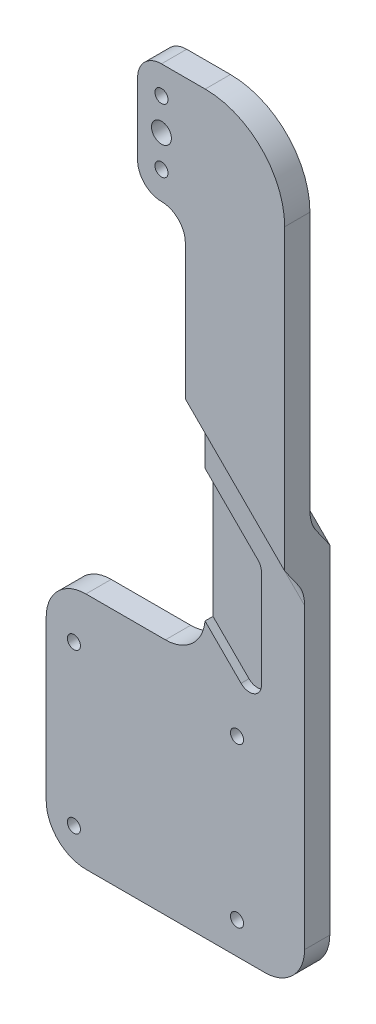
ISO-10303-21;
HEADER;
FILE_DESCRIPTION(('STEP AP214'),'2;1');
FILE_NAME('part.step','',(''),(''),'','','');
FILE_SCHEMA(('AUTOMOTIVE_DESIGN { 1 0 10303 214 1 1 1 1 }'));
ENDSEC;
DATA;
#1=APPLICATION_CONTEXT('core data for automotive mechanical design processes');
#2=APPLICATION_PROTOCOL_DEFINITION('international standard','automotive_design',2000,#1);
#3=PRODUCT_CONTEXT('',#1,'mechanical');
#4=PRODUCT('Part','Part','',(#3));
#5=PRODUCT_RELATED_PRODUCT_CATEGORY('part','',(#4));
#6=PRODUCT_DEFINITION_FORMATION('','',#4);
#7=PRODUCT_DEFINITION_CONTEXT('part definition',#1,'design');
#8=PRODUCT_DEFINITION('design','',#6,#7);
#9=PRODUCT_DEFINITION_SHAPE('','',#8);
#10=(LENGTH_UNIT() NAMED_UNIT(*) SI_UNIT(.MILLI.,.METRE.));
#11=(NAMED_UNIT(*) PLANE_ANGLE_UNIT() SI_UNIT($,.RADIAN.));
#12=(NAMED_UNIT(*) SI_UNIT($,.STERADIAN.) SOLID_ANGLE_UNIT());
#13=UNCERTAINTY_MEASURE_WITH_UNIT(LENGTH_MEASURE(1.E-05),#10,'distance_accuracy_value','');
#14=(GEOMETRIC_REPRESENTATION_CONTEXT(3) GLOBAL_UNCERTAINTY_ASSIGNED_CONTEXT((#13)) GLOBAL_UNIT_ASSIGNED_CONTEXT((#10,
#11,#12)) REPRESENTATION_CONTEXT('',''));
#15=CARTESIAN_POINT('',(0.,0.,0.));
#16=DIRECTION('',(0.,0.,1.));
#17=DIRECTION('',(1.,0.,0.));
#18=AXIS2_PLACEMENT_3D('',#15,#16,#17);
#19=CARTESIAN_POINT('',(6.,0.,6.35));
#20=DIRECTION('',(-1.,0.,0.));
#21=DIRECTION('',(0.,0.,1.));
#22=AXIS2_PLACEMENT_3D('',#19,#20,#21);
#23=PLANE('',#22);
#24=DIRECTION('',(0.,1.,0.));
#25=VECTOR('',#24,1.);
#26=CARTESIAN_POINT('',(6.00000000000002,-175.,-5.));
#27=LINE('',#26,#25);
#28=CARTESIAN_POINT('',(6.00000000000001,-105.,-5.));
#29=VERTEX_POINT('',#28);
#30=CARTESIAN_POINT('',(6.,-55.0000000000002,-5.));
#31=VERTEX_POINT('',#30);
#32=EDGE_CURVE('E278',#29,#31,#27,.T.);
#33=ORIENTED_EDGE('',*,*,#32,.F.);
#34=DIRECTION('',(0.,0.,1.));
#35=VECTOR('',#34,1.);
#36=CARTESIAN_POINT('',(6.,-105.,1.35));
#37=LINE('',#36,#35);
#38=CARTESIAN_POINT('',(6.,-105.,-0.65));
#39=VERTEX_POINT('',#38);
#40=EDGE_CURVE('E246',#29,#39,#37,.T.);
#41=ORIENTED_EDGE('',*,*,#40,.T.);
#42=DIRECTION('',(0.,-1.,0.));
#43=VECTOR('',#42,1.);
#44=CARTESIAN_POINT('',(6.,0.,-0.65));
#45=LINE('',#44,#43);
#46=CARTESIAN_POINT('',(6.,-72.6859435315228,-0.650000000000006));
#47=VERTEX_POINT('',#46);
#48=EDGE_CURVE('E226',#47,#39,#45,.T.);
#49=ORIENTED_EDGE('',*,*,#48,.F.);
#50=DIRECTION('',(0.,0.,-1.));
#51=VECTOR('',#50,1.);
#52=CARTESIAN_POINT('',(6.,-72.6859435315228,245.414474269938));
#53=LINE('',#52,#51);
#54=CARTESIAN_POINT('',(6.,-72.6859435315228,1.34999999999999));
#55=VERTEX_POINT('',#54);
#56=EDGE_CURVE('E231',#55,#47,#53,.T.);
#57=ORIENTED_EDGE('',*,*,#56,.F.);
#58=DIRECTION('',(0.,-1.,0.));
#59=VECTOR('',#58,1.);
#60=CARTESIAN_POINT('',(6.,0.,1.35));
#61=LINE('',#60,#59);
#62=CARTESIAN_POINT('',(6.,-65.0000000000002,1.35));
#63=VERTEX_POINT('',#62);
#64=EDGE_CURVE('E293',#63,#55,#61,.T.);
#65=ORIENTED_EDGE('',*,*,#64,.F.);
#66=CARTESIAN_POINT('',(6.,-65.0000000000002,6.35));
#67=DIRECTION('',(-1.,0.,0.));
#68=DIRECTION('',(0.,1.,0.));
#69=AXIS2_PLACEMENT_3D('',#66,#67,#68);
#70=ELLIPSE('',#69,7.07106781186544,5.);
#71=CARTESIAN_POINT('',(6.,-60.0000000000002,2.81446609406725));
#72=VERTEX_POINT('',#71);
#73=EDGE_CURVE('E442',#63,#72,#70,.F.);
#74=ORIENTED_EDGE('',*,*,#73,.T.);
#75=DIRECTION('',(0.,0.816496580927727,0.577350269189625));
#76=VECTOR('',#75,1.);
#77=CARTESIAN_POINT('',(6.,-39.3807118745773,17.394504550793));
#78=LINE('',#77,#76);
#79=CARTESIAN_POINT('',(6.,-55.0000000000002,6.35));
#80=VERTEX_POINT('',#79);
#81=EDGE_CURVE('E407',#72,#80,#78,.T.);
#82=ORIENTED_EDGE('',*,*,#81,.T.);
#83=DIRECTION('',(0.,1.,0.));
#84=VECTOR('',#83,1.);
#85=CARTESIAN_POINT('',(6.,0.,6.35));
#86=LINE('',#85,#84);
#87=CARTESIAN_POINT('',(6.,-21.,6.35));
#88=VERTEX_POINT('',#87);
#89=EDGE_CURVE('E317',#80,#88,#86,.T.);
#90=ORIENTED_EDGE('',*,*,#89,.T.);
#91=DIRECTION('',(0.,0.,-1.));
#92=VECTOR('',#91,1.);
#93=CARTESIAN_POINT('',(6.,-21.,6.35));
#94=LINE('',#93,#92);
#95=CARTESIAN_POINT('',(6.,-21.,0.));
#96=VERTEX_POINT('',#95);
#97=EDGE_CURVE('E332',#88,#96,#94,.T.);
#98=ORIENTED_EDGE('',*,*,#97,.T.);
#99=DIRECTION('',(0.,1.,0.));
#100=VECTOR('',#99,1.);
#101=CARTESIAN_POINT('',(6.,0.,0.));
#102=LINE('',#101,#100);
#103=CARTESIAN_POINT('',(6.,-45.0000000000003,0.));
#104=VERTEX_POINT('',#103);
#105=EDGE_CURVE('E345',#104,#96,#102,.T.);
#106=ORIENTED_EDGE('',*,*,#105,.F.);
#107=CARTESIAN_POINT('',(6.,-45.0000000000003,-5.));
#108=DIRECTION('',(-1.,0.,0.));
#109=DIRECTION('',(0.,1.,0.));
#110=AXIS2_PLACEMENT_3D('',#107,#108,#109);
#111=ELLIPSE('',#110,7.07106781186544,5.);
#112=CARTESIAN_POINT('',(6.,-50.0000000000003,-1.46446609406729));
#113=VERTEX_POINT('',#112);
#114=EDGE_CURVE('E436',#104,#113,#111,.F.);
#115=ORIENTED_EDGE('',*,*,#114,.T.);
#116=DIRECTION('',(0.,0.816496580927722,0.577350269189632));
#117=VECTOR('',#116,1.);
#118=CARTESIAN_POINT('',(6.,-55.0000000000002,-5.00000000000003));
#119=LINE('',#118,#117);
#120=EDGE_CURVE('E418',#113,#31,#119,.F.);
#121=ORIENTED_EDGE('',*,*,#120,.T.);
#122=EDGE_LOOP('',(#33,#41,#49,#57,#65,#74,#82,#90,#98,#106,#115,#121));
#123=FACE_BOUND('',#122,.T.);
#124=ADVANCED_FACE('F41',(#123),#23,.T.);
#125=CARTESIAN_POINT('',(0.,0.,1.35));
#126=DIRECTION('',(0.,0.,1.));
#127=DIRECTION('',(1.,0.,0.));
#128=AXIS2_PLACEMENT_3D('',#125,#126,#127);
#129=PLANE('',#128);
#130=CARTESIAN_POINT('',(14.,-167.,1.35));
#131=DIRECTION('',(0.,0.,1.));
#132=DIRECTION('',(1.,0.,0.));
#133=AXIS2_PLACEMENT_3D('',#130,#131,#132);
#134=CIRCLE('',#133,1.65000000000001);
#135=CARTESIAN_POINT('',(15.65,-167.,1.35));
#136=VERTEX_POINT('',#135);
#137=EDGE_CURVE('E282',#136,#136,#134,.F.);
#138=ORIENTED_EDGE('',*,*,#137,.T.);
#139=EDGE_LOOP('',(#138));
#140=FACE_BOUND('',#139,.T.);
#141=CARTESIAN_POINT('',(14.,-127.,1.35));
#142=DIRECTION('',(0.,0.,1.));
#143=DIRECTION('',(1.,0.,0.));
#144=AXIS2_PLACEMENT_3D('',#141,#142,#143);
#145=CIRCLE('',#144,1.65000000000001);
#146=CARTESIAN_POINT('',(15.65,-127.,1.35));
#147=VERTEX_POINT('',#146);
#148=EDGE_CURVE('E286',#147,#147,#145,.F.);
#149=ORIENTED_EDGE('',*,*,#148,.T.);
#150=EDGE_LOOP('',(#149));
#151=FACE_BOUND('',#150,.T.);
#152=DIRECTION('',(1.,0.,0.));
#153=VECTOR('',#152,1.);
#154=CARTESIAN_POINT('',(0.,-175.,1.35));
#155=LINE('',#154,#153);
#156=CARTESIAN_POINT('',(-24.,-175.,1.35));
#157=VERTEX_POINT('',#156);
#158=CARTESIAN_POINT('',(21.,-175.,1.35));
#159=VERTEX_POINT('',#158);
#160=EDGE_CURVE('E296',#157,#159,#155,.T.);
#161=ORIENTED_EDGE('',*,*,#160,.T.);
#162=CARTESIAN_POINT('',(21.,-165.,1.35));
#163=DIRECTION('',(0.,0.,1.));
#164=DIRECTION('',(1.,0.,0.));
#165=AXIS2_PLACEMENT_3D('',#162,#163,#164);
#166=CIRCLE('',#165,10.);
#167=CARTESIAN_POINT('',(31.,-165.,1.35));
#168=VERTEX_POINT('',#167);
#169=EDGE_CURVE('E507',#159,#168,#166,.T.);
#170=ORIENTED_EDGE('',*,*,#169,.T.);
#171=DIRECTION('',(0.,1.,0.));
#172=VECTOR('',#171,1.);
#173=CARTESIAN_POINT('',(31.,0.,1.35));
#174=LINE('',#173,#172);
#175=CARTESIAN_POINT('',(31.,-89.9999999999999,1.35));
#176=VERTEX_POINT('',#175);
#177=EDGE_CURVE('E290',#168,#176,#174,.T.);
#178=ORIENTED_EDGE('',*,*,#177,.T.);
#179=DIRECTION('',(-0.707106781186551,0.707106781186544,0.));
#180=VECTOR('',#179,1.);
#181=CARTESIAN_POINT('',(-29.5000000000001,-29.5000000000004,1.35));
#182=LINE('',#181,#180);
#183=EDGE_CURVE('E429',#176,#63,#182,.T.);
#184=ORIENTED_EDGE('',*,*,#183,.T.);
#185=ORIENTED_EDGE('',*,*,#64,.T.);
#186=DIRECTION('',(-0.707106781186551,0.707106781186544,0.));
#187=VECTOR('',#186,1.);
#188=CARTESIAN_POINT('',(20.142135623731,-86.8280791552536,1.34999999999999));
#189=LINE('',#188,#187);
#190=CARTESIAN_POINT('',(19.2634559672906,-85.9493994988132,1.34999999999999));
#191=VERTEX_POINT('',#190);
#192=EDGE_CURVE('E237',#191,#55,#189,.T.);
#193=ORIENTED_EDGE('',*,*,#192,.F.);
#194=CARTESIAN_POINT('',(17.142135623731,-88.0707198423729,1.34999999999999));
#195=DIRECTION('',(0.,0.,1.));
#196=DIRECTION('',(1.,0.,0.));
#197=AXIS2_PLACEMENT_3D('',#194,#195,#196);
#198=CIRCLE('',#197,3.);
#199=CARTESIAN_POINT('',(20.142135623731,-88.0707198423729,1.34999999999999));
#200=VERTEX_POINT('',#199);
#201=EDGE_CURVE('E467',#191,#200,#198,.F.);
#202=ORIENTED_EDGE('',*,*,#201,.T.);
#203=DIRECTION('',(0.,1.,0.));
#204=VECTOR('',#203,1.);
#205=CARTESIAN_POINT('',(20.142135623731,-120.082609769215,1.34999999999999));
#206=LINE('',#205,#204);
#207=CARTESIAN_POINT('',(20.142135623731,-112.839969082096,1.34999999999999));
#208=VERTEX_POINT('',#207);
#209=EDGE_CURVE('E588',#208,#200,#206,.T.);
#210=ORIENTED_EDGE('',*,*,#209,.F.);
#211=CARTESIAN_POINT('',(17.142135623731,-112.839969082096,1.34999999999999));
#212=DIRECTION('',(0.,0.,1.));
#213=DIRECTION('',(1.,0.,0.));
#214=AXIS2_PLACEMENT_3D('',#211,#212,#213);
#215=CIRCLE('',#214,3.);
#216=CARTESIAN_POINT('',(15.0208152801713,-114.961289425655,1.34999999999999));
#217=VERTEX_POINT('',#216);
#218=EDGE_CURVE('E470',#208,#217,#215,.F.);
#219=ORIENTED_EDGE('',*,*,#218,.T.);
#220=DIRECTION('',(0.707106781186547,-0.707106781186548,0.));
#221=VECTOR('',#220,1.);
#222=CARTESIAN_POINT('',(6.00000000000001,-105.940474145484,1.34999999999999));
#223=LINE('',#222,#221);
#224=CARTESIAN_POINT('',(5.95942662060434,-105.899900766088,1.34999999999999));
#225=VERTEX_POINT('',#224);
#226=EDGE_CURVE('E57',#225,#217,#223,.T.);
#227=ORIENTED_EDGE('',*,*,#226,.F.);
#228=CARTESIAN_POINT('',(-4.,-105.,1.35));
#229=DIRECTION('',(0.,0.,1.));
#230=DIRECTION('',(1.,0.,0.));
#231=AXIS2_PLACEMENT_3D('',#228,#229,#230);
#232=CIRCLE('',#231,10.);
#233=CARTESIAN_POINT('',(-4.,-115.,1.35));
#234=VERTEX_POINT('',#233);
#235=EDGE_CURVE('E50',#225,#234,#232,.F.);
#236=ORIENTED_EDGE('',*,*,#235,.T.);
#237=DIRECTION('',(-1.,0.,0.));
#238=VECTOR('',#237,1.);
#239=CARTESIAN_POINT('',(6.00000000000002,-115.,1.35));
#240=LINE('',#239,#238);
#241=CARTESIAN_POINT('',(-24.,-115.,1.35));
#242=VERTEX_POINT('',#241);
#243=EDGE_CURVE('E528',#234,#242,#240,.T.);
#244=ORIENTED_EDGE('',*,*,#243,.T.);
#245=CARTESIAN_POINT('',(-24.,-125.,1.35));
#246=DIRECTION('',(0.,0.,1.));
#247=DIRECTION('',(1.,0.,0.));
#248=AXIS2_PLACEMENT_3D('',#245,#246,#247);
#249=CIRCLE('',#248,10.);
#250=CARTESIAN_POINT('',(-34.,-125.,1.35));
#251=VERTEX_POINT('',#250);
#252=EDGE_CURVE('E501',#242,#251,#249,.T.);
#253=ORIENTED_EDGE('',*,*,#252,.T.);
#254=DIRECTION('',(0.,-1.,0.));
#255=VECTOR('',#254,1.);
#256=CARTESIAN_POINT('',(-34.,-175.,1.35));
#257=LINE('',#256,#255);
#258=CARTESIAN_POINT('',(-34.,-165.,1.35));
#259=VERTEX_POINT('',#258);
#260=EDGE_CURVE('E538',#251,#259,#257,.T.);
#261=ORIENTED_EDGE('',*,*,#260,.T.);
#262=CARTESIAN_POINT('',(-24.,-165.,1.35));
#263=DIRECTION('',(0.,0.,1.));
#264=DIRECTION('',(1.,0.,0.));
#265=AXIS2_PLACEMENT_3D('',#262,#263,#264);
#266=CIRCLE('',#265,10.);
#267=EDGE_CURVE('E504',#259,#157,#266,.T.);
#268=ORIENTED_EDGE('',*,*,#267,.T.);
#269=EDGE_LOOP('',(#161,#170,#178,#184,#185,#193,#202,#210,#219,#227,#236,#244,#253,#261,#268));
#270=FACE_BOUND('',#269,.T.);
#271=CARTESIAN_POINT('',(-27.0315901100417,-167.,1.35));
#272=DIRECTION('',(0.,0.,1.));
#273=DIRECTION('',(1.,0.,0.));
#274=AXIS2_PLACEMENT_3D('',#271,#272,#273);
#275=CIRCLE('',#274,1.65);
#276=CARTESIAN_POINT('',(-25.3815901100417,-167.,1.35));
#277=VERTEX_POINT('',#276);
#278=EDGE_CURVE('E539',#277,#277,#275,.T.);
#279=ORIENTED_EDGE('',*,*,#278,.F.);
#280=EDGE_LOOP('',(#279));
#281=FACE_BOUND('',#280,.T.);
#282=CARTESIAN_POINT('',(-27.0315901100417,-127.,1.35));
#283=DIRECTION('',(0.,0.,1.));
#284=DIRECTION('',(1.,0.,0.));
#285=AXIS2_PLACEMENT_3D('',#282,#283,#284);
#286=CIRCLE('',#285,1.65);
#287=CARTESIAN_POINT('',(-25.3815901100417,-127.,1.35));
#288=VERTEX_POINT('',#287);
#289=EDGE_CURVE('E584',#288,#288,#286,.T.);
#290=ORIENTED_EDGE('',*,*,#289,.F.);
#291=EDGE_LOOP('',(#290));
#292=FACE_BOUND('',#291,.T.);
#293=ADVANCED_FACE('F526',(#140,#151,#270,#281,#292),#129,.T.);
#294=CARTESIAN_POINT('',(0.,0.,0.));
#295=DIRECTION('',(0.,0.,1.));
#296=DIRECTION('',(1.,0.,0.));
#297=AXIS2_PLACEMENT_3D('',#294,#295,#296);
#298=PLANE('',#297);
#299=CARTESIAN_POINT('',(0.,8.,0.));
#300=DIRECTION('',(0.,0.,1.));
#301=DIRECTION('',(1.,0.,0.));
#302=AXIS2_PLACEMENT_3D('',#299,#300,#301);
#303=CIRCLE('',#302,1.65);
#304=CARTESIAN_POINT('',(1.65,8.,0.));
#305=VERTEX_POINT('',#304);
#306=EDGE_CURVE('E309',#305,#305,#303,.T.);
#307=ORIENTED_EDGE('',*,*,#306,.T.);
#308=EDGE_LOOP('',(#307));
#309=FACE_BOUND('',#308,.T.);
#310=CARTESIAN_POINT('',(0.,0.,0.));
#311=DIRECTION('',(0.,0.,1.));
#312=DIRECTION('',(1.,0.,0.));
#313=AXIS2_PLACEMENT_3D('',#310,#311,#312);
#314=CIRCLE('',#313,2.5);
#315=CARTESIAN_POINT('',(2.5,0.,0.));
#316=VERTEX_POINT('',#315);
#317=EDGE_CURVE('E352',#316,#316,#314,.T.);
#318=ORIENTED_EDGE('',*,*,#317,.T.);
#319=EDGE_LOOP('',(#318));
#320=FACE_BOUND('',#319,.T.);
#321=CARTESIAN_POINT('',(0.,-8.,0.));
#322=DIRECTION('',(0.,0.,1.));
#323=DIRECTION('',(1.,0.,0.));
#324=AXIS2_PLACEMENT_3D('',#321,#322,#323);
#325=CIRCLE('',#324,1.65);
#326=CARTESIAN_POINT('',(1.65,-8.,0.));
#327=VERTEX_POINT('',#326);
#328=EDGE_CURVE('E348',#327,#327,#325,.T.);
#329=ORIENTED_EDGE('',*,*,#328,.T.);
#330=EDGE_LOOP('',(#329));
#331=FACE_BOUND('',#330,.T.);
#332=DIRECTION('',(0.,-1.,0.));
#333=VECTOR('',#332,1.);
#334=CARTESIAN_POINT('',(31.,0.,0.));
#335=LINE('',#334,#333);
#336=CARTESIAN_POINT('',(31.,-5.,0.));
#337=VERTEX_POINT('',#336);
#338=CARTESIAN_POINT('',(31.,-70.,0.));
#339=VERTEX_POINT('',#338);
#340=EDGE_CURVE('E333',#337,#339,#335,.T.);
#341=ORIENTED_EDGE('',*,*,#340,.T.);
#342=DIRECTION('',(0.707106781186551,-0.707106781186544,0.));
#343=VECTOR('',#342,1.);
#344=CARTESIAN_POINT('',(7.46446609406727,-46.4644660940675,0.));
#345=LINE('',#344,#343);
#346=EDGE_CURVE('E422',#339,#104,#345,.F.);
#347=ORIENTED_EDGE('',*,*,#346,.T.);
#348=ORIENTED_EDGE('',*,*,#105,.T.);
#349=CARTESIAN_POINT('',(0.,-21.,0.));
#350=DIRECTION('',(0.,0.,1.));
#351=DIRECTION('',(1.,0.,0.));
#352=AXIS2_PLACEMENT_3D('',#349,#350,#351);
#353=CIRCLE('',#352,6.);
#354=CARTESIAN_POINT('',(0.,-15.,0.));
#355=VERTEX_POINT('',#354);
#356=EDGE_CURVE('E371',#96,#355,#353,.T.);
#357=ORIENTED_EDGE('',*,*,#356,.T.);
#358=CARTESIAN_POINT('',(0.,-9.,0.));
#359=DIRECTION('',(0.,0.,1.));
#360=DIRECTION('',(1.,0.,0.));
#361=AXIS2_PLACEMENT_3D('',#358,#359,#360);
#362=CIRCLE('',#361,6.);
#363=CARTESIAN_POINT('',(-6.,-9.,0.));
#364=VERTEX_POINT('',#363);
#365=EDGE_CURVE('E362',#355,#364,#362,.F.);
#366=ORIENTED_EDGE('',*,*,#365,.T.);
#367=DIRECTION('',(0.,1.,0.));
#368=VECTOR('',#367,1.);
#369=CARTESIAN_POINT('',(-6.,0.,0.));
#370=LINE('',#369,#368);
#371=CARTESIAN_POINT('',(-6.,9.,0.));
#372=VERTEX_POINT('',#371);
#373=EDGE_CURVE('E341',#364,#372,#370,.T.);
#374=ORIENTED_EDGE('',*,*,#373,.T.);
#375=CARTESIAN_POINT('',(0.,9.,0.));
#376=DIRECTION('',(0.,0.,1.));
#377=DIRECTION('',(1.,0.,0.));
#378=AXIS2_PLACEMENT_3D('',#375,#376,#377);
#379=CIRCLE('',#378,6.);
#380=CARTESIAN_POINT('',(0.,15.,0.));
#381=VERTEX_POINT('',#380);
#382=EDGE_CURVE('E385',#372,#381,#379,.F.);
#383=ORIENTED_EDGE('',*,*,#382,.T.);
#384=DIRECTION('',(1.,0.,0.));
#385=VECTOR('',#384,1.);
#386=CARTESIAN_POINT('',(0.,15.,0.));
#387=LINE('',#386,#385);
#388=CARTESIAN_POINT('',(11.,15.,0.));
#389=VERTEX_POINT('',#388);
#390=EDGE_CURVE('E337',#381,#389,#387,.T.);
#391=ORIENTED_EDGE('',*,*,#390,.T.);
#392=CARTESIAN_POINT('',(11.,-5.,0.));
#393=DIRECTION('',(0.,0.,1.));
#394=DIRECTION('',(1.,0.,0.));
#395=AXIS2_PLACEMENT_3D('',#392,#393,#394);
#396=CIRCLE('',#395,20.);
#397=EDGE_CURVE('E398',#389,#337,#396,.F.);
#398=ORIENTED_EDGE('',*,*,#397,.T.);
#399=EDGE_LOOP('',(#341,#347,#348,#357,#366,#374,#383,#391,#398));
#400=FACE_BOUND('',#399,.T.);
#401=ADVANCED_FACE('F623',(#309,#320,#331,#400),#298,.F.);
#402=CARTESIAN_POINT('',(0.,-175.,6.35));
#403=DIRECTION('',(0.,1.,0.));
#404=DIRECTION('',(0.,0.,1.));
#405=AXIS2_PLACEMENT_3D('',#402,#403,#404);
#406=PLANE('',#405);
#407=DIRECTION('',(-1.,0.,0.));
#408=VECTOR('',#407,1.);
#409=CARTESIAN_POINT('',(31.,-175.,-5.));
#410=LINE('',#409,#408);
#411=CARTESIAN_POINT('',(21.,-175.,-5.));
#412=VERTEX_POINT('',#411);
#413=CARTESIAN_POINT('',(-24.,-175.,-5.));
#414=VERTEX_POINT('',#413);
#415=EDGE_CURVE('E274',#412,#414,#410,.T.);
#416=ORIENTED_EDGE('',*,*,#415,.F.);
#417=DIRECTION('',(0.,0.,-1.));
#418=VECTOR('',#417,1.);
#419=CARTESIAN_POINT('',(21.,-175.,1.35));
#420=LINE('',#419,#418);
#421=EDGE_CURVE('E498',#412,#159,#420,.F.);
#422=ORIENTED_EDGE('',*,*,#421,.T.);
#423=ORIENTED_EDGE('',*,*,#160,.F.);
#424=DIRECTION('',(0.,0.,1.));
#425=VECTOR('',#424,1.);
#426=CARTESIAN_POINT('',(-24.,-175.,-5.));
#427=LINE('',#426,#425);
#428=EDGE_CURVE('E495',#157,#414,#427,.F.);
#429=ORIENTED_EDGE('',*,*,#428,.T.);
#430=EDGE_LOOP('',(#416,#422,#423,#429));
#431=FACE_BOUND('',#430,.T.);
#432=ADVANCED_FACE('F566',(#431),#406,.F.);
#433=CARTESIAN_POINT('',(14.,-127.,-3.65));
#434=DIRECTION('',(0.,0.,1.));
#435=DIRECTION('',(1.,0.,0.));
#436=AXIS2_PLACEMENT_3D('',#433,#434,#435);
#437=CYLINDRICAL_SURFACE('',#436,1.65000000000001);
#438=ORIENTED_EDGE('',*,*,#148,.F.);
#439=EDGE_LOOP('',(#438));
#440=FACE_BOUND('',#439,.T.);
#441=CARTESIAN_POINT('',(14.,-127.,-5.));
#442=DIRECTION('',(0.,0.,1.));
#443=DIRECTION('',(1.,0.,0.));
#444=AXIS2_PLACEMENT_3D('',#441,#442,#443);
#445=CIRCLE('',#444,1.65000000000001);
#446=CARTESIAN_POINT('',(15.65,-127.,-5.));
#447=VERTEX_POINT('',#446);
#448=EDGE_CURVE('E258',#447,#447,#445,.T.);
#449=ORIENTED_EDGE('',*,*,#448,.F.);
#450=EDGE_LOOP('',(#449));
#451=FACE_BOUND('',#450,.T.);
#452=ADVANCED_FACE('F755',(#440,#451),#437,.F.);
#453=CARTESIAN_POINT('',(14.,-167.,-3.65));
#454=DIRECTION('',(0.,0.,1.));
#455=DIRECTION('',(1.,0.,0.));
#456=AXIS2_PLACEMENT_3D('',#453,#454,#455);
#457=CYLINDRICAL_SURFACE('',#456,1.65000000000001);
#458=ORIENTED_EDGE('',*,*,#137,.F.);
#459=EDGE_LOOP('',(#458));
#460=FACE_BOUND('',#459,.T.);
#461=CARTESIAN_POINT('',(14.,-167.,-5.));
#462=DIRECTION('',(0.,0.,1.));
#463=DIRECTION('',(1.,0.,0.));
#464=AXIS2_PLACEMENT_3D('',#461,#462,#463);
#465=CIRCLE('',#464,1.65000000000002);
#466=CARTESIAN_POINT('',(15.65,-167.,-5.));
#467=VERTEX_POINT('',#466);
#468=EDGE_CURVE('E263',#467,#467,#465,.T.);
#469=ORIENTED_EDGE('',*,*,#468,.F.);
#470=EDGE_LOOP('',(#469));
#471=FACE_BOUND('',#470,.T.);
#472=ADVANCED_FACE('F640',(#460,#471),#457,.F.);
#473=CARTESIAN_POINT('',(31.,0.,6.35));
#474=DIRECTION('',(1.,0.,0.));
#475=DIRECTION('',(0.,1.,0.));
#476=AXIS2_PLACEMENT_3D('',#473,#474,#475);
#477=PLANE('',#476);
#478=ORIENTED_EDGE('',*,*,#177,.F.);
#479=DIRECTION('',(0.,0.,-1.));
#480=VECTOR('',#479,1.);
#481=CARTESIAN_POINT('',(31.,-165.,-5.));
#482=LINE('',#481,#480);
#483=CARTESIAN_POINT('',(31.,-165.,-5.));
#484=VERTEX_POINT('',#483);
#485=EDGE_CURVE('E482',#168,#484,#482,.T.);
#486=ORIENTED_EDGE('',*,*,#485,.T.);
#487=DIRECTION('',(0.,-1.,0.));
#488=VECTOR('',#487,1.);
#489=CARTESIAN_POINT('',(31.,-80.,-5.));
#490=LINE('',#489,#488);
#491=CARTESIAN_POINT('',(31.,-80.,-5.));
#492=VERTEX_POINT('',#491);
#493=EDGE_CURVE('E270',#492,#484,#490,.T.);
#494=ORIENTED_EDGE('',*,*,#493,.F.);
#495=DIRECTION('',(0.,-0.816496580927722,-0.577350269189632));
#496=VECTOR('',#495,1.);
#497=CARTESIAN_POINT('',(31.,-63.3333333333337,6.78511301977571));
#498=LINE('',#497,#496);
#499=CARTESIAN_POINT('',(31.,-75.0000000000001,-1.46446609406729));
#500=VERTEX_POINT('',#499);
#501=EDGE_CURVE('E414',#492,#500,#498,.F.);
#502=ORIENTED_EDGE('',*,*,#501,.T.);
#503=CARTESIAN_POINT('',(31.,-70.0000000000001,-5.));
#504=DIRECTION('',(1.,0.,0.));
#505=DIRECTION('',(0.,1.,0.));
#506=AXIS2_PLACEMENT_3D('',#503,#504,#505);
#507=ELLIPSE('',#506,7.07106781186544,5.);
#508=EDGE_CURVE('E439',#500,#339,#507,.F.);
#509=ORIENTED_EDGE('',*,*,#508,.T.);
#510=ORIENTED_EDGE('',*,*,#340,.F.);
#511=DIRECTION('',(0.,0.,-1.));
#512=VECTOR('',#511,1.);
#513=CARTESIAN_POINT('',(31.,-5.,6.35));
#514=LINE('',#513,#512);
#515=CARTESIAN_POINT('',(31.,-5.,6.35));
#516=VERTEX_POINT('',#515);
#517=EDGE_CURVE('E401',#337,#516,#514,.F.);
#518=ORIENTED_EDGE('',*,*,#517,.T.);
#519=DIRECTION('',(0.,-1.,0.));
#520=VECTOR('',#519,1.);
#521=CARTESIAN_POINT('',(31.,0.,6.35));
#522=LINE('',#521,#520);
#523=CARTESIAN_POINT('',(31.,-80.,6.35));
#524=VERTEX_POINT('',#523);
#525=EDGE_CURVE('E304',#516,#524,#522,.T.);
#526=ORIENTED_EDGE('',*,*,#525,.T.);
#527=DIRECTION('',(0.,-0.816496580927727,-0.577350269189625));
#528=VECTOR('',#527,1.);
#529=CARTESIAN_POINT('',(31.,-47.7140452079105,29.1796175705687));
#530=LINE('',#529,#528);
#531=CARTESIAN_POINT('',(31.,-85.,2.81446609406724));
#532=VERTEX_POINT('',#531);
#533=EDGE_CURVE('E410',#524,#532,#530,.T.);
#534=ORIENTED_EDGE('',*,*,#533,.T.);
#535=CARTESIAN_POINT('',(31.,-89.9999999999999,6.35));
#536=DIRECTION('',(1.,0.,0.));
#537=DIRECTION('',(0.,1.,0.));
#538=AXIS2_PLACEMENT_3D('',#535,#536,#537);
#539=ELLIPSE('',#538,7.07106781186544,5.);
#540=EDGE_CURVE('E445',#532,#176,#539,.F.);
#541=ORIENTED_EDGE('',*,*,#540,.T.);
#542=EDGE_LOOP('',(#478,#486,#494,#502,#509,#510,#518,#526,#534,#541));
#543=FACE_BOUND('',#542,.T.);
#544=ADVANCED_FACE('F557',(#543),#477,.T.);
#545=CARTESIAN_POINT('',(0.,15.,6.35));
#546=DIRECTION('',(0.,1.,0.));
#547=DIRECTION('',(0.,0.,1.));
#548=AXIS2_PLACEMENT_3D('',#545,#546,#547);
#549=PLANE('',#548);
#550=DIRECTION('',(1.,0.,0.));
#551=VECTOR('',#550,1.);
#552=CARTESIAN_POINT('',(0.,15.,6.35));
#553=LINE('',#552,#551);
#554=CARTESIAN_POINT('',(0.,15.,6.35));
#555=VERTEX_POINT('',#554);
#556=CARTESIAN_POINT('',(11.,15.,6.35));
#557=VERTEX_POINT('',#556);
#558=EDGE_CURVE('E308',#555,#557,#553,.T.);
#559=ORIENTED_EDGE('',*,*,#558,.T.);
#560=DIRECTION('',(0.,0.,-1.));
#561=VECTOR('',#560,1.);
#562=CARTESIAN_POINT('',(11.,15.,6.35));
#563=LINE('',#562,#561);
#564=EDGE_CURVE('E394',#557,#389,#563,.T.);
#565=ORIENTED_EDGE('',*,*,#564,.T.);
#566=ORIENTED_EDGE('',*,*,#390,.F.);
#567=DIRECTION('',(0.,0.,-1.));
#568=VECTOR('',#567,1.);
#569=CARTESIAN_POINT('',(0.,15.,6.35));
#570=LINE('',#569,#568);
#571=EDGE_CURVE('E388',#381,#555,#570,.F.);
#572=ORIENTED_EDGE('',*,*,#571,.T.);
#573=EDGE_LOOP('',(#559,#565,#566,#572));
#574=FACE_BOUND('',#573,.T.);
#575=ADVANCED_FACE('F633',(#574),#549,.T.);
#576=CARTESIAN_POINT('',(-6.,0.,6.35));
#577=DIRECTION('',(-1.,0.,0.));
#578=DIRECTION('',(0.,-1.,0.));
#579=AXIS2_PLACEMENT_3D('',#576,#577,#578);
#580=PLANE('',#579);
#581=DIRECTION('',(0.,1.,0.));
#582=VECTOR('',#581,1.);
#583=CARTESIAN_POINT('',(-6.,0.,6.35));
#584=LINE('',#583,#582);
#585=CARTESIAN_POINT('',(-6.,-9.,6.35));
#586=VERTEX_POINT('',#585);
#587=CARTESIAN_POINT('',(-6.,9.,6.35));
#588=VERTEX_POINT('',#587);
#589=EDGE_CURVE('E313',#586,#588,#584,.T.);
#590=ORIENTED_EDGE('',*,*,#589,.T.);
#591=DIRECTION('',(0.,0.,-1.));
#592=VECTOR('',#591,1.);
#593=CARTESIAN_POINT('',(-6.,9.,6.35));
#594=LINE('',#593,#592);
#595=EDGE_CURVE('E378',#588,#372,#594,.T.);
#596=ORIENTED_EDGE('',*,*,#595,.T.);
#597=ORIENTED_EDGE('',*,*,#373,.F.);
#598=DIRECTION('',(0.,0.,-1.));
#599=VECTOR('',#598,1.);
#600=CARTESIAN_POINT('',(-6.,-9.,6.35));
#601=LINE('',#600,#599);
#602=EDGE_CURVE('E365',#364,#586,#601,.F.);
#603=ORIENTED_EDGE('',*,*,#602,.T.);
#604=EDGE_LOOP('',(#590,#596,#597,#603));
#605=FACE_BOUND('',#604,.T.);
#606=ADVANCED_FACE('F629',(#605),#580,.T.);
#607=CARTESIAN_POINT('',(0.,0.,6.35));
#608=DIRECTION('',(0.,0.,-1.));
#609=DIRECTION('',(-1.,0.,0.));
#610=AXIS2_PLACEMENT_3D('',#607,#608,#609);
#611=CYLINDRICAL_SURFACE('',#610,2.5);
#612=CARTESIAN_POINT('',(0.,0.,6.35));
#613=DIRECTION('',(0.,0.,1.));
#614=DIRECTION('',(1.,0.,0.));
#615=AXIS2_PLACEMENT_3D('',#612,#613,#614);
#616=CIRCLE('',#615,2.5);
#617=CARTESIAN_POINT('',(2.5,0.,6.35));
#618=VERTEX_POINT('',#617);
#619=EDGE_CURVE('E324',#618,#618,#616,.T.);
#620=ORIENTED_EDGE('',*,*,#619,.T.);
#621=EDGE_LOOP('',(#620));
#622=FACE_BOUND('',#621,.T.);
#623=ORIENTED_EDGE('',*,*,#317,.F.);
#624=EDGE_LOOP('',(#623));
#625=FACE_BOUND('',#624,.T.);
#626=ADVANCED_FACE('F632',(#622,#625),#611,.F.);
#627=CARTESIAN_POINT('',(0.,-8.,6.35));
#628=DIRECTION('',(0.,0.,-1.));
#629=DIRECTION('',(-1.,0.,0.));
#630=AXIS2_PLACEMENT_3D('',#627,#628,#629);
#631=CYLINDRICAL_SURFACE('',#630,1.65);
#632=CARTESIAN_POINT('',(0.,-8.,6.35));
#633=DIRECTION('',(0.,0.,1.));
#634=DIRECTION('',(1.,0.,0.));
#635=AXIS2_PLACEMENT_3D('',#632,#633,#634);
#636=CIRCLE('',#635,1.65);
#637=CARTESIAN_POINT('',(1.65,-8.,6.35));
#638=VERTEX_POINT('',#637);
#639=EDGE_CURVE('E320',#638,#638,#636,.T.);
#640=ORIENTED_EDGE('',*,*,#639,.T.);
#641=EDGE_LOOP('',(#640));
#642=FACE_BOUND('',#641,.T.);
#643=ORIENTED_EDGE('',*,*,#328,.F.);
#644=EDGE_LOOP('',(#643));
#645=FACE_BOUND('',#644,.T.);
#646=ADVANCED_FACE('F792',(#642,#645),#631,.F.);
#647=CARTESIAN_POINT('',(0.,8.,6.35));
#648=DIRECTION('',(0.,0.,-1.));
#649=DIRECTION('',(-1.,0.,0.));
#650=AXIS2_PLACEMENT_3D('',#647,#648,#649);
#651=CYLINDRICAL_SURFACE('',#650,1.65);
#652=CARTESIAN_POINT('',(0.,8.,6.35));
#653=DIRECTION('',(0.,0.,1.));
#654=DIRECTION('',(1.,0.,0.));
#655=AXIS2_PLACEMENT_3D('',#652,#653,#654);
#656=CIRCLE('',#655,1.65);
#657=CARTESIAN_POINT('',(1.65,8.,6.35));
#658=VERTEX_POINT('',#657);
#659=EDGE_CURVE('E328',#658,#658,#656,.T.);
#660=ORIENTED_EDGE('',*,*,#659,.T.);
#661=EDGE_LOOP('',(#660));
#662=FACE_BOUND('',#661,.T.);
#663=ORIENTED_EDGE('',*,*,#306,.F.);
#664=EDGE_LOOP('',(#663));
#665=FACE_BOUND('',#664,.T.);
#666=ADVANCED_FACE('F800',(#662,#665),#651,.F.);
#667=CARTESIAN_POINT('',(0.,0.,6.35));
#668=DIRECTION('',(0.,0.,1.));
#669=DIRECTION('',(1.,0.,0.));
#670=AXIS2_PLACEMENT_3D('',#667,#668,#669);
#671=PLANE('',#670);
#672=DIRECTION('',(-0.707106781186551,0.707106781186544,0.));
#673=VECTOR('',#672,1.);
#674=CARTESIAN_POINT('',(-24.5000000000001,-24.5000000000004,6.35));
#675=LINE('',#674,#673);
#676=EDGE_CURVE('E281',#524,#80,#675,.T.);
#677=ORIENTED_EDGE('',*,*,#676,.F.);
#678=ORIENTED_EDGE('',*,*,#525,.F.);
#679=CARTESIAN_POINT('',(11.,-5.,6.35));
#680=DIRECTION('',(0.,0.,1.));
#681=DIRECTION('',(1.,0.,0.));
#682=AXIS2_PLACEMENT_3D('',#679,#680,#681);
#683=CIRCLE('',#682,20.);
#684=EDGE_CURVE('E404',#516,#557,#683,.T.);
#685=ORIENTED_EDGE('',*,*,#684,.T.);
#686=ORIENTED_EDGE('',*,*,#558,.F.);
#687=CARTESIAN_POINT('',(0.,9.,6.35));
#688=DIRECTION('',(0.,0.,1.));
#689=DIRECTION('',(1.,0.,0.));
#690=AXIS2_PLACEMENT_3D('',#687,#688,#689);
#691=CIRCLE('',#690,6.);
#692=EDGE_CURVE('E391',#555,#588,#691,.T.);
#693=ORIENTED_EDGE('',*,*,#692,.T.);
#694=ORIENTED_EDGE('',*,*,#589,.F.);
#695=CARTESIAN_POINT('',(0.,-9.,6.35));
#696=DIRECTION('',(0.,0.,1.));
#697=DIRECTION('',(1.,0.,0.));
#698=AXIS2_PLACEMENT_3D('',#695,#696,#697);
#699=CIRCLE('',#698,6.);
#700=CARTESIAN_POINT('',(0.,-15.,6.35));
#701=VERTEX_POINT('',#700);
#702=EDGE_CURVE('E368',#586,#701,#699,.T.);
#703=ORIENTED_EDGE('',*,*,#702,.T.);
#704=CARTESIAN_POINT('',(0.,-21.,6.35));
#705=DIRECTION('',(0.,0.,1.));
#706=DIRECTION('',(1.,0.,0.));
#707=AXIS2_PLACEMENT_3D('',#704,#705,#706);
#708=CIRCLE('',#707,6.);
#709=EDGE_CURVE('E374',#701,#88,#708,.F.);
#710=ORIENTED_EDGE('',*,*,#709,.T.);
#711=ORIENTED_EDGE('',*,*,#89,.F.);
#712=EDGE_LOOP('',(#677,#678,#685,#686,#693,#694,#703,#710,#711));
#713=FACE_BOUND('',#712,.T.);
#714=ORIENTED_EDGE('',*,*,#639,.F.);
#715=EDGE_LOOP('',(#714));
#716=FACE_BOUND('',#715,.T.);
#717=ORIENTED_EDGE('',*,*,#619,.F.);
#718=EDGE_LOOP('',(#717));
#719=FACE_BOUND('',#718,.T.);
#720=ORIENTED_EDGE('',*,*,#659,.F.);
#721=EDGE_LOOP('',(#720));
#722=FACE_BOUND('',#721,.T.);
#723=ADVANCED_FACE('F649',(#713,#716,#719,#722),#671,.T.);
#724=CARTESIAN_POINT('',(0.,-9.,6.35));
#725=DIRECTION('',(0.,0.,1.));
#726=DIRECTION('',(1.,0.,0.));
#727=AXIS2_PLACEMENT_3D('',#724,#725,#726);
#728=CYLINDRICAL_SURFACE('',#727,6.);
#729=DIRECTION('',(0.,0.,-1.));
#730=VECTOR('',#729,1.);
#731=CARTESIAN_POINT('',(0.,-15.,0.));
#732=LINE('',#731,#730);
#733=EDGE_CURVE('E300',#701,#355,#732,.T.);
#734=ORIENTED_EDGE('',*,*,#733,.F.);
#735=ORIENTED_EDGE('',*,*,#702,.F.);
#736=ORIENTED_EDGE('',*,*,#602,.F.);
#737=ORIENTED_EDGE('',*,*,#365,.F.);
#738=EDGE_LOOP('',(#734,#735,#736,#737));
#739=FACE_BOUND('',#738,.T.);
#740=ADVANCED_FACE('F645',(#739),#728,.T.);
#741=CARTESIAN_POINT('',(0.,-21.,6.35));
#742=DIRECTION('',(0.,0.,-1.));
#743=DIRECTION('',(-1.,0.,0.));
#744=AXIS2_PLACEMENT_3D('',#741,#742,#743);
#745=CYLINDRICAL_SURFACE('',#744,6.);
#746=ORIENTED_EDGE('',*,*,#709,.F.);
#747=ORIENTED_EDGE('',*,*,#733,.T.);
#748=ORIENTED_EDGE('',*,*,#356,.F.);
#749=ORIENTED_EDGE('',*,*,#97,.F.);
#750=EDGE_LOOP('',(#746,#747,#748,#749));
#751=FACE_BOUND('',#750,.T.);
#752=ADVANCED_FACE('F641',(#751),#745,.F.);
#753=CARTESIAN_POINT('',(0.,9.,6.35));
#754=DIRECTION('',(0.,0.,-1.));
#755=DIRECTION('',(-1.,0.,0.));
#756=AXIS2_PLACEMENT_3D('',#753,#754,#755);
#757=CYLINDRICAL_SURFACE('',#756,6.);
#758=ORIENTED_EDGE('',*,*,#692,.F.);
#759=ORIENTED_EDGE('',*,*,#571,.F.);
#760=ORIENTED_EDGE('',*,*,#382,.F.);
#761=ORIENTED_EDGE('',*,*,#595,.F.);
#762=EDGE_LOOP('',(#758,#759,#760,#761));
#763=FACE_BOUND('',#762,.T.);
#764=ADVANCED_FACE('F644',(#763),#757,.T.);
#765=CARTESIAN_POINT('',(11.,-5.,6.35));
#766=DIRECTION('',(0.,0.,-1.));
#767=DIRECTION('',(-1.,0.,0.));
#768=AXIS2_PLACEMENT_3D('',#765,#766,#767);
#769=CYLINDRICAL_SURFACE('',#768,20.);
#770=ORIENTED_EDGE('',*,*,#684,.F.);
#771=ORIENTED_EDGE('',*,*,#517,.F.);
#772=ORIENTED_EDGE('',*,*,#397,.F.);
#773=ORIENTED_EDGE('',*,*,#564,.F.);
#774=EDGE_LOOP('',(#770,#771,#772,#773));
#775=FACE_BOUND('',#774,.T.);
#776=ADVANCED_FACE('F653',(#775),#769,.T.);
#777=CARTESIAN_POINT('',(0.,0.,-5.));
#778=DIRECTION('',(0.,0.,-1.));
#779=DIRECTION('',(-1.,0.,0.));
#780=AXIS2_PLACEMENT_3D('',#777,#778,#779);
#781=PLANE('',#780);
#782=ORIENTED_EDGE('',*,*,#448,.T.);
#783=EDGE_LOOP('',(#782));
#784=FACE_BOUND('',#783,.T.);
#785=ORIENTED_EDGE('',*,*,#468,.T.);
#786=EDGE_LOOP('',(#785));
#787=FACE_BOUND('',#786,.T.);
#788=ORIENTED_EDGE('',*,*,#493,.T.);
#789=CARTESIAN_POINT('',(21.,-165.,-5.));
#790=DIRECTION('',(0.,0.,-1.));
#791=DIRECTION('',(-1.,0.,0.));
#792=AXIS2_PLACEMENT_3D('',#789,#790,#791);
#793=CIRCLE('',#792,10.);
#794=EDGE_CURVE('E492',#484,#412,#793,.T.);
#795=ORIENTED_EDGE('',*,*,#794,.T.);
#796=ORIENTED_EDGE('',*,*,#415,.T.);
#797=CARTESIAN_POINT('',(-24.,-165.,-5.));
#798=DIRECTION('',(0.,0.,-1.));
#799=DIRECTION('',(-1.,0.,0.));
#800=AXIS2_PLACEMENT_3D('',#797,#798,#799);
#801=CIRCLE('',#800,10.);
#802=CARTESIAN_POINT('',(-34.,-165.,-5.));
#803=VERTEX_POINT('',#802);
#804=EDGE_CURVE('E489',#414,#803,#801,.T.);
#805=ORIENTED_EDGE('',*,*,#804,.T.);
#806=DIRECTION('',(0.,-1.,0.));
#807=VECTOR('',#806,1.);
#808=CARTESIAN_POINT('',(-34.,-175.,-5.));
#809=LINE('',#808,#807);
#810=CARTESIAN_POINT('',(-34.,-125.,-5.));
#811=VERTEX_POINT('',#810);
#812=EDGE_CURVE('E579',#811,#803,#809,.T.);
#813=ORIENTED_EDGE('',*,*,#812,.F.);
#814=CARTESIAN_POINT('',(-24.,-125.,-5.));
#815=DIRECTION('',(0.,0.,-1.));
#816=DIRECTION('',(-1.,0.,0.));
#817=AXIS2_PLACEMENT_3D('',#814,#815,#816);
#818=CIRCLE('',#817,10.);
#819=CARTESIAN_POINT('',(-24.,-115.,-5.));
#820=VERTEX_POINT('',#819);
#821=EDGE_CURVE('E486',#811,#820,#818,.T.);
#822=ORIENTED_EDGE('',*,*,#821,.T.);
#823=DIRECTION('',(-1.,0.,0.));
#824=VECTOR('',#823,1.);
#825=CARTESIAN_POINT('',(6.00000000000002,-115.,-5.));
#826=LINE('',#825,#824);
#827=CARTESIAN_POINT('',(-4.,-115.,-5.));
#828=VERTEX_POINT('',#827);
#829=EDGE_CURVE('E546',#828,#820,#826,.T.);
#830=ORIENTED_EDGE('',*,*,#829,.F.);
#831=CARTESIAN_POINT('',(-4.,-105.,-5.));
#832=DIRECTION('',(0.,0.,-1.));
#833=DIRECTION('',(-1.,0.,0.));
#834=AXIS2_PLACEMENT_3D('',#831,#832,#833);
#835=CIRCLE('',#834,10.);
#836=EDGE_CURVE('E11',#828,#29,#835,.F.);
#837=ORIENTED_EDGE('',*,*,#836,.T.);
#838=ORIENTED_EDGE('',*,*,#32,.T.);
#839=DIRECTION('',(0.707106781186551,-0.707106781186544,0.));
#840=VECTOR('',#839,1.);
#841=CARTESIAN_POINT('',(6.,-55.0000000000002,-5.));
#842=LINE('',#841,#840);
#843=EDGE_CURVE('E262',#31,#492,#842,.T.);
#844=ORIENTED_EDGE('',*,*,#843,.T.);
#845=EDGE_LOOP('',(#788,#795,#796,#805,#813,#822,#830,#837,#838,#844));
#846=FACE_BOUND('',#845,.T.);
#847=CARTESIAN_POINT('',(-27.0315901100417,-167.,-5.));
#848=DIRECTION('',(0.,0.,-1.));
#849=DIRECTION('',(-1.,0.,0.));
#850=AXIS2_PLACEMENT_3D('',#847,#848,#849);
#851=CIRCLE('',#850,1.65);
#852=CARTESIAN_POINT('',(-28.6815901100417,-167.,-5.));
#853=VERTEX_POINT('',#852);
#854=EDGE_CURVE('E254',#853,#853,#851,.F.);
#855=ORIENTED_EDGE('',*,*,#854,.T.);
#856=EDGE_LOOP('',(#855));
#857=FACE_BOUND('',#856,.T.);
#858=CARTESIAN_POINT('',(-27.0315901100417,-127.,-5.));
#859=DIRECTION('',(0.,0.,-1.));
#860=DIRECTION('',(-1.,0.,0.));
#861=AXIS2_PLACEMENT_3D('',#858,#859,#860);
#862=CIRCLE('',#861,1.65);
#863=CARTESIAN_POINT('',(-28.6815901100417,-127.,-5.));
#864=VERTEX_POINT('',#863);
#865=EDGE_CURVE('E248',#864,#864,#862,.F.);
#866=ORIENTED_EDGE('',*,*,#865,.T.);
#867=EDGE_LOOP('',(#866));
#868=FACE_BOUND('',#867,.T.);
#869=ADVANCED_FACE('F544',(#784,#787,#846,#857,#868),#781,.T.);
#870=CARTESIAN_POINT('',(-28.0355339059329,-28.0355339059332,1.35));
#871=DIRECTION('',(0.499999999999995,0.500000000000001,-0.70710678118655));
#872=DIRECTION('',(-0.707106781186551,0.707106781186544,0.));
#873=AXIS2_PLACEMENT_3D('',#870,#871,#872);
#874=PLANE('',#873);
#875=ORIENTED_EDGE('',*,*,#81,.F.);
#876=DIRECTION('',(-0.707106781186551,0.707106781186544,0.));
#877=VECTOR('',#876,1.);
#878=CARTESIAN_POINT('',(-27.0000000000001,-27.0000000000004,2.81446609406725));
#879=LINE('',#878,#877);
#880=EDGE_CURVE('E433',#72,#532,#879,.F.);
#881=ORIENTED_EDGE('',*,*,#880,.T.);
#882=ORIENTED_EDGE('',*,*,#533,.F.);
#883=ORIENTED_EDGE('',*,*,#676,.T.);
#884=EDGE_LOOP('',(#875,#881,#882,#883));
#885=FACE_BOUND('',#884,.T.);
#886=ADVANCED_FACE('F658',(#885),#874,.F.);
#887=CARTESIAN_POINT('',(6.,-55.0000000000002,-5.00000000000003));
#888=DIRECTION('',(0.5,0.500000000000005,-0.707106781186544));
#889=DIRECTION('',(-0.707106781186551,0.707106781186544,0.));
#890=AXIS2_PLACEMENT_3D('',#887,#888,#889);
#891=PLANE('',#890);
#892=ORIENTED_EDGE('',*,*,#120,.F.);
#893=DIRECTION('',(-0.707106781186551,0.707106781186544,0.));
#894=VECTOR('',#893,1.);
#895=CARTESIAN_POINT('',(29.9644660940673,-73.9644660940673,-1.46446609406729));
#896=LINE('',#895,#894);
#897=EDGE_CURVE('E426',#113,#500,#896,.F.);
#898=ORIENTED_EDGE('',*,*,#897,.T.);
#899=ORIENTED_EDGE('',*,*,#501,.F.);
#900=ORIENTED_EDGE('',*,*,#843,.F.);
#901=EDGE_LOOP('',(#892,#898,#899,#900));
#902=FACE_BOUND('',#901,.T.);
#903=ADVANCED_FACE('F552',(#902),#891,.T.);
#904=CARTESIAN_POINT('',(-19.5000000000002,-19.5000000000004,-5.));
#905=DIRECTION('',(-0.707106781186551,0.707106781186544,0.));
#906=DIRECTION('',(-0.707106781186544,-0.707106781186551,0.));
#907=AXIS2_PLACEMENT_3D('',#904,#905,#906);
#908=CYLINDRICAL_SURFACE('',#907,5.);
#909=ORIENTED_EDGE('',*,*,#508,.F.);
#910=ORIENTED_EDGE('',*,*,#897,.F.);
#911=ORIENTED_EDGE('',*,*,#114,.F.);
#912=ORIENTED_EDGE('',*,*,#346,.F.);
#913=EDGE_LOOP('',(#909,#910,#911,#912));
#914=FACE_BOUND('',#913,.T.);
#915=ADVANCED_FACE('F664',(#914),#908,.F.);
#916=CARTESIAN_POINT('',(-29.5000000000001,-29.5000000000004,6.35));
#917=DIRECTION('',(-0.707106781186551,0.707106781186544,0.));
#918=DIRECTION('',(-0.707106781186544,-0.707106781186551,0.));
#919=AXIS2_PLACEMENT_3D('',#916,#917,#918);
#920=CYLINDRICAL_SURFACE('',#919,5.);
#921=ORIENTED_EDGE('',*,*,#540,.F.);
#922=ORIENTED_EDGE('',*,*,#880,.F.);
#923=ORIENTED_EDGE('',*,*,#73,.F.);
#924=ORIENTED_EDGE('',*,*,#183,.F.);
#925=EDGE_LOOP('',(#921,#922,#923,#924));
#926=FACE_BOUND('',#925,.T.);
#927=ADVANCED_FACE('F667',(#926),#920,.F.);
#928=CARTESIAN_POINT('',(20.142135623731,-86.8280791552536,245.414474269938));
#929=DIRECTION('',(-0.707106781186544,-0.707106781186551,0.));
#930=DIRECTION('',(0.707106781186551,-0.707106781186544,0.));
#931=AXIS2_PLACEMENT_3D('',#928,#929,#930);
#932=PLANE('',#931);
#933=DIRECTION('',(-0.707106781186551,0.707106781186544,0.));
#934=VECTOR('',#933,1.);
#935=CARTESIAN_POINT('',(20.142135623731,-86.8280791552536,-0.650000000000012));
#936=LINE('',#935,#934);
#937=CARTESIAN_POINT('',(19.2634559672906,-85.9493994988132,-0.650000000000012));
#938=VERTEX_POINT('',#937);
#939=EDGE_CURVE('E221',#938,#47,#936,.T.);
#940=ORIENTED_EDGE('',*,*,#939,.F.);
#941=DIRECTION('',(0.,0.,-1.));
#942=VECTOR('',#941,1.);
#943=CARTESIAN_POINT('',(19.2634559672906,-85.9493994988132,1.34999999999999));
#944=LINE('',#943,#942);
#945=EDGE_CURVE('E461',#938,#191,#944,.F.);
#946=ORIENTED_EDGE('',*,*,#945,.T.);
#947=ORIENTED_EDGE('',*,*,#192,.T.);
#948=ORIENTED_EDGE('',*,*,#56,.T.);
#949=EDGE_LOOP('',(#940,#946,#947,#948));
#950=FACE_BOUND('',#949,.T.);
#951=ADVANCED_FACE('F235',(#950),#932,.T.);
#952=CARTESIAN_POINT('',(20.142135623731,-120.082609769215,245.414474269938));
#953=DIRECTION('',(-1.,0.,0.));
#954=DIRECTION('',(0.,0.,1.));
#955=AXIS2_PLACEMENT_3D('',#952,#953,#954);
#956=PLANE('',#955);
#957=ORIENTED_EDGE('',*,*,#209,.T.);
#958=DIRECTION('',(0.,0.,-1.));
#959=VECTOR('',#958,1.);
#960=CARTESIAN_POINT('',(20.142135623731,-88.0707198423729,-0.650000000000012));
#961=LINE('',#960,#959);
#962=CARTESIAN_POINT('',(20.142135623731,-88.0707198423729,-0.650000000000012));
#963=VERTEX_POINT('',#962);
#964=EDGE_CURVE('E452',#200,#963,#961,.T.);
#965=ORIENTED_EDGE('',*,*,#964,.T.);
#966=DIRECTION('',(0.,1.,0.));
#967=VECTOR('',#966,1.);
#968=CARTESIAN_POINT('',(20.142135623731,-120.082609769215,-0.650000000000012));
#969=LINE('',#968,#967);
#970=CARTESIAN_POINT('',(20.142135623731,-112.839969082096,-0.650000000000012));
#971=VERTEX_POINT('',#970);
#972=EDGE_CURVE('E232',#971,#963,#969,.T.);
#973=ORIENTED_EDGE('',*,*,#972,.F.);
#974=DIRECTION('',(0.,0.,-1.));
#975=VECTOR('',#974,1.);
#976=CARTESIAN_POINT('',(20.142135623731,-112.839969082096,1.34999999999999));
#977=LINE('',#976,#975);
#978=EDGE_CURVE('E449',#971,#208,#977,.F.);
#979=ORIENTED_EDGE('',*,*,#978,.T.);
#980=EDGE_LOOP('',(#957,#965,#973,#979));
#981=FACE_BOUND('',#980,.T.);
#982=ADVANCED_FACE('F598',(#981),#956,.T.);
#983=CARTESIAN_POINT('',(6.00000000000001,-105.940474145484,245.414474269938));
#984=DIRECTION('',(0.707106781186548,0.707106781186547,0.));
#985=DIRECTION('',(-0.707106781186547,0.707106781186548,0.));
#986=AXIS2_PLACEMENT_3D('',#983,#984,#985);
#987=PLANE('',#986);
#988=ORIENTED_EDGE('',*,*,#226,.T.);
#989=DIRECTION('',(0.,0.,-1.));
#990=VECTOR('',#989,1.);
#991=CARTESIAN_POINT('',(15.0208152801713,-114.961289425655,-0.650000000000012));
#992=LINE('',#991,#990);
#993=CARTESIAN_POINT('',(15.0208152801713,-114.961289425655,-0.650000000000012));
#994=VERTEX_POINT('',#993);
#995=EDGE_CURVE('E464',#217,#994,#992,.T.);
#996=ORIENTED_EDGE('',*,*,#995,.T.);
#997=DIRECTION('',(0.707106781186547,-0.707106781186548,0.));
#998=VECTOR('',#997,1.);
#999=CARTESIAN_POINT('',(6.00000000000001,-105.940474145484,-0.650000000000012));
#1000=LINE('',#999,#998);
#1001=CARTESIAN_POINT('',(5.95942662060434,-105.899900766088,-0.650000000000012));
#1002=VERTEX_POINT('',#1001);
#1003=EDGE_CURVE('E64',#1002,#994,#1000,.T.);
#1004=ORIENTED_EDGE('',*,*,#1003,.F.);
#1005=DIRECTION('',(0.,0.,-1.));
#1006=VECTOR('',#1005,1.);
#1007=CARTESIAN_POINT('',(5.95942662060434,-105.899900766088,-0.65));
#1008=LINE('',#1007,#1006);
#1009=EDGE_CURVE('E520',#1002,#225,#1008,.F.);
#1010=ORIENTED_EDGE('',*,*,#1009,.T.);
#1011=EDGE_LOOP('',(#988,#996,#1004,#1010));
#1012=FACE_BOUND('',#1011,.T.);
#1013=ADVANCED_FACE('F605',(#1012),#987,.T.);
#1014=CARTESIAN_POINT('',(0.,0.,-0.65));
#1015=DIRECTION('',(0.,0.,1.));
#1016=DIRECTION('',(1.,0.,0.));
#1017=AXIS2_PLACEMENT_3D('',#1014,#1015,#1016);
#1018=PLANE('',#1017);
#1019=ORIENTED_EDGE('',*,*,#972,.T.);
#1020=CARTESIAN_POINT('',(17.142135623731,-88.0707198423729,-0.650000000000012));
#1021=DIRECTION('',(0.,0.,1.));
#1022=DIRECTION('',(1.,0.,0.));
#1023=AXIS2_PLACEMENT_3D('',#1020,#1021,#1022);
#1024=CIRCLE('',#1023,3.);
#1025=EDGE_CURVE('E227',#963,#938,#1024,.T.);
#1026=ORIENTED_EDGE('',*,*,#1025,.T.);
#1027=ORIENTED_EDGE('',*,*,#939,.T.);
#1028=ORIENTED_EDGE('',*,*,#48,.T.);
#1029=CARTESIAN_POINT('',(-4.,-105.,-0.65));
#1030=DIRECTION('',(0.,0.,1.));
#1031=DIRECTION('',(1.,0.,0.));
#1032=AXIS2_PLACEMENT_3D('',#1029,#1030,#1031);
#1033=CIRCLE('',#1032,10.);
#1034=EDGE_CURVE('E517',#39,#1002,#1033,.F.);
#1035=ORIENTED_EDGE('',*,*,#1034,.T.);
#1036=ORIENTED_EDGE('',*,*,#1003,.T.);
#1037=CARTESIAN_POINT('',(17.142135623731,-112.839969082096,-0.650000000000012));
#1038=DIRECTION('',(0.,0.,1.));
#1039=DIRECTION('',(1.,0.,0.));
#1040=AXIS2_PLACEMENT_3D('',#1037,#1038,#1039);
#1041=CIRCLE('',#1040,3.);
#1042=EDGE_CURVE('E456',#994,#971,#1041,.T.);
#1043=ORIENTED_EDGE('',*,*,#1042,.T.);
#1044=EDGE_LOOP('',(#1019,#1026,#1027,#1028,#1035,#1036,#1043));
#1045=FACE_BOUND('',#1044,.T.);
#1046=ADVANCED_FACE('F224',(#1045),#1018,.T.);
#1047=CARTESIAN_POINT('',(17.142135623731,-88.0707198423729,245.414474269938));
#1048=DIRECTION('',(0.,0.,1.));
#1049=DIRECTION('',(1.,0.,0.));
#1050=AXIS2_PLACEMENT_3D('',#1047,#1048,#1049);
#1051=CYLINDRICAL_SURFACE('',#1050,3.);
#1052=ORIENTED_EDGE('',*,*,#201,.F.);
#1053=ORIENTED_EDGE('',*,*,#945,.F.);
#1054=ORIENTED_EDGE('',*,*,#1025,.F.);
#1055=ORIENTED_EDGE('',*,*,#964,.F.);
#1056=EDGE_LOOP('',(#1052,#1053,#1054,#1055));
#1057=FACE_BOUND('',#1056,.T.);
#1058=ADVANCED_FACE('F612',(#1057),#1051,.F.);
#1059=CARTESIAN_POINT('',(17.142135623731,-112.839969082096,245.414474269938));
#1060=DIRECTION('',(0.,0.,1.));
#1061=DIRECTION('',(1.,0.,0.));
#1062=AXIS2_PLACEMENT_3D('',#1059,#1060,#1061);
#1063=CYLINDRICAL_SURFACE('',#1062,3.);
#1064=ORIENTED_EDGE('',*,*,#218,.F.);
#1065=ORIENTED_EDGE('',*,*,#978,.F.);
#1066=ORIENTED_EDGE('',*,*,#1042,.F.);
#1067=ORIENTED_EDGE('',*,*,#995,.F.);
#1068=EDGE_LOOP('',(#1064,#1065,#1066,#1067));
#1069=FACE_BOUND('',#1068,.T.);
#1070=ADVANCED_FACE('F603',(#1069),#1063,.F.);
#1071=CARTESIAN_POINT('',(-34.,-175.,-77.1110255092798));
#1072=DIRECTION('',(-1.,0.,0.));
#1073=DIRECTION('',(0.,0.,1.));
#1074=AXIS2_PLACEMENT_3D('',#1071,#1072,#1073);
#1075=PLANE('',#1074);
#1076=ORIENTED_EDGE('',*,*,#812,.T.);
#1077=DIRECTION('',(0.,0.,1.));
#1078=VECTOR('',#1077,1.);
#1079=CARTESIAN_POINT('',(-34.,-165.,1.35));
#1080=LINE('',#1079,#1078);
#1081=EDGE_CURVE('E513',#803,#259,#1080,.T.);
#1082=ORIENTED_EDGE('',*,*,#1081,.T.);
#1083=ORIENTED_EDGE('',*,*,#260,.F.);
#1084=DIRECTION('',(0.,0.,1.));
#1085=VECTOR('',#1084,1.);
#1086=CARTESIAN_POINT('',(-34.,-125.,-77.1110255092798));
#1087=LINE('',#1086,#1085);
#1088=EDGE_CURVE('E510',#251,#811,#1087,.F.);
#1089=ORIENTED_EDGE('',*,*,#1088,.T.);
#1090=EDGE_LOOP('',(#1076,#1082,#1083,#1089));
#1091=FACE_BOUND('',#1090,.T.);
#1092=ADVANCED_FACE('F576',(#1091),#1075,.T.);
#1093=CARTESIAN_POINT('',(6.00000000000002,-115.,-77.1110255092798));
#1094=DIRECTION('',(0.,1.,0.));
#1095=DIRECTION('',(0.,0.,1.));
#1096=AXIS2_PLACEMENT_3D('',#1093,#1094,#1095);
#1097=PLANE('',#1096);
#1098=ORIENTED_EDGE('',*,*,#243,.F.);
#1099=DIRECTION('',(0.,0.,1.));
#1100=VECTOR('',#1099,1.);
#1101=CARTESIAN_POINT('',(-4.,-115.,-5.));
#1102=LINE('',#1101,#1100);
#1103=EDGE_CURVE('E479',#234,#828,#1102,.F.);
#1104=ORIENTED_EDGE('',*,*,#1103,.T.);
#1105=ORIENTED_EDGE('',*,*,#829,.T.);
#1106=DIRECTION('',(0.,0.,1.));
#1107=VECTOR('',#1106,1.);
#1108=CARTESIAN_POINT('',(-24.,-115.,-77.1110255092798));
#1109=LINE('',#1108,#1107);
#1110=EDGE_CURVE('E475',#820,#242,#1109,.T.);
#1111=ORIENTED_EDGE('',*,*,#1110,.T.);
#1112=EDGE_LOOP('',(#1098,#1104,#1105,#1111));
#1113=FACE_BOUND('',#1112,.T.);
#1114=ADVANCED_FACE('F533',(#1113),#1097,.T.);
#1115=CARTESIAN_POINT('',(-27.0315901100417,-127.,-77.1110255092798));
#1116=DIRECTION('',(0.,0.,1.));
#1117=DIRECTION('',(1.,0.,0.));
#1118=AXIS2_PLACEMENT_3D('',#1115,#1116,#1117);
#1119=CYLINDRICAL_SURFACE('',#1118,1.65);
#1120=ORIENTED_EDGE('',*,*,#289,.T.);
#1121=EDGE_LOOP('',(#1120));
#1122=FACE_BOUND('',#1121,.T.);
#1123=ORIENTED_EDGE('',*,*,#865,.F.);
#1124=EDGE_LOOP('',(#1123));
#1125=FACE_BOUND('',#1124,.T.);
#1126=ADVANCED_FACE('F715',(#1122,#1125),#1119,.F.);
#1127=CARTESIAN_POINT('',(-27.0315901100417,-167.,-77.1110255092798));
#1128=DIRECTION('',(0.,0.,1.));
#1129=DIRECTION('',(1.,0.,0.));
#1130=AXIS2_PLACEMENT_3D('',#1127,#1128,#1129);
#1131=CYLINDRICAL_SURFACE('',#1130,1.65);
#1132=ORIENTED_EDGE('',*,*,#278,.T.);
#1133=EDGE_LOOP('',(#1132));
#1134=FACE_BOUND('',#1133,.T.);
#1135=ORIENTED_EDGE('',*,*,#854,.F.);
#1136=EDGE_LOOP('',(#1135));
#1137=FACE_BOUND('',#1136,.T.);
#1138=ADVANCED_FACE('F679',(#1134,#1137),#1131,.F.);
#1139=CARTESIAN_POINT('',(-4.,-105.,6.35));
#1140=DIRECTION('',(0.,0.,-1.));
#1141=DIRECTION('',(-1.,0.,0.));
#1142=AXIS2_PLACEMENT_3D('',#1139,#1140,#1141);
#1143=CYLINDRICAL_SURFACE('',#1142,10.);
#1144=ORIENTED_EDGE('',*,*,#836,.F.);
#1145=ORIENTED_EDGE('',*,*,#1103,.F.);
#1146=ORIENTED_EDGE('',*,*,#235,.F.);
#1147=ORIENTED_EDGE('',*,*,#1009,.F.);
#1148=ORIENTED_EDGE('',*,*,#1034,.F.);
#1149=ORIENTED_EDGE('',*,*,#40,.F.);
#1150=EDGE_LOOP('',(#1144,#1145,#1146,#1147,#1148,#1149));
#1151=FACE_BOUND('',#1150,.T.);
#1152=ADVANCED_FACE('F542',(#1151),#1143,.F.);
#1153=CARTESIAN_POINT('',(21.,-165.,6.35));
#1154=DIRECTION('',(0.,0.,1.));
#1155=DIRECTION('',(1.,0.,0.));
#1156=AXIS2_PLACEMENT_3D('',#1153,#1154,#1155);
#1157=CYLINDRICAL_SURFACE('',#1156,10.);
#1158=ORIENTED_EDGE('',*,*,#169,.F.);
#1159=ORIENTED_EDGE('',*,*,#421,.F.);
#1160=ORIENTED_EDGE('',*,*,#794,.F.);
#1161=ORIENTED_EDGE('',*,*,#485,.F.);
#1162=EDGE_LOOP('',(#1158,#1159,#1160,#1161));
#1163=FACE_BOUND('',#1162,.T.);
#1164=ADVANCED_FACE('F562',(#1163),#1157,.T.);
#1165=CARTESIAN_POINT('',(-24.,-165.,-77.1110255092798));
#1166=DIRECTION('',(0.,0.,-1.));
#1167=DIRECTION('',(-1.,0.,0.));
#1168=AXIS2_PLACEMENT_3D('',#1165,#1166,#1167);
#1169=CYLINDRICAL_SURFACE('',#1168,10.);
#1170=ORIENTED_EDGE('',*,*,#804,.F.);
#1171=ORIENTED_EDGE('',*,*,#428,.F.);
#1172=ORIENTED_EDGE('',*,*,#267,.F.);
#1173=ORIENTED_EDGE('',*,*,#1081,.F.);
#1174=EDGE_LOOP('',(#1170,#1171,#1172,#1173));
#1175=FACE_BOUND('',#1174,.T.);
#1176=ADVANCED_FACE('F573',(#1175),#1169,.T.);
#1177=CARTESIAN_POINT('',(-24.,-125.,-77.1110255092798));
#1178=DIRECTION('',(0.,0.,1.));
#1179=DIRECTION('',(1.,0.,0.));
#1180=AXIS2_PLACEMENT_3D('',#1177,#1178,#1179);
#1181=CYLINDRICAL_SURFACE('',#1180,10.);
#1182=ORIENTED_EDGE('',*,*,#821,.F.);
#1183=ORIENTED_EDGE('',*,*,#1088,.F.);
#1184=ORIENTED_EDGE('',*,*,#252,.F.);
#1185=ORIENTED_EDGE('',*,*,#1110,.F.);
#1186=EDGE_LOOP('',(#1182,#1183,#1184,#1185));
#1187=FACE_BOUND('',#1186,.T.);
#1188=ADVANCED_FACE('F43',(#1187),#1181,.T.);
#1189=CLOSED_SHELL('',(#124,#293,#401,#432,#452,#472,#544,#575,#606,#626,#646,#666,#723,#740,
#752,#764,#776,#869,#886,#903,#915,#927,#951,#982,#1013,#1046,#1058,#1070,#1092,#1114,#1126,
#1138,#1152,#1164,#1176,#1188));
#1190=MANIFOLD_SOLID_BREP('B2',#1189);
#1191=ADVANCED_BREP_SHAPE_REPRESENTATION('',(#18,#1190),#14);
#1192=SHAPE_DEFINITION_REPRESENTATION(#9,#1191);
ENDSEC;
END-ISO-10303-21;
